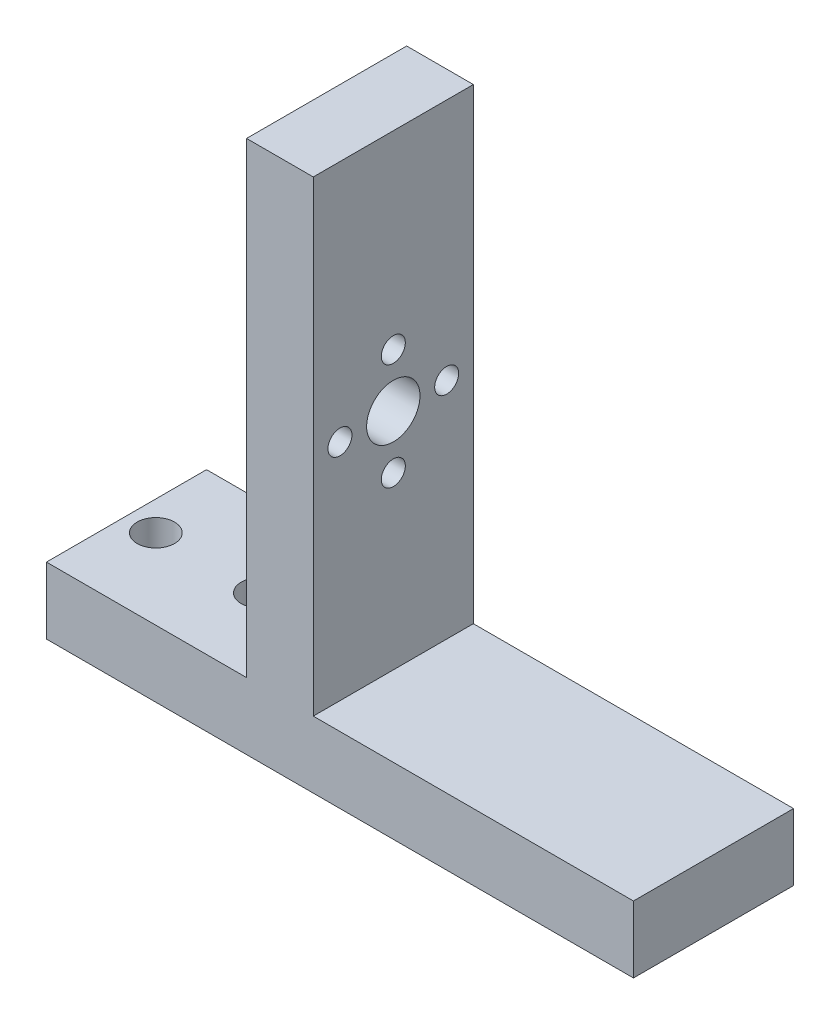
ISO-10303-21;
HEADER;
FILE_DESCRIPTION(('STEP AP214'),'2;1');
FILE_NAME('part.step','',(''),(''),'','','');
FILE_SCHEMA(('AUTOMOTIVE_DESIGN { 1 0 10303 214 1 1 1 1 }'));
ENDSEC;
DATA;
#1=APPLICATION_CONTEXT('core data for automotive mechanical design processes');
#2=APPLICATION_PROTOCOL_DEFINITION('international standard','automotive_design',2000,#1);
#3=PRODUCT_CONTEXT('',#1,'mechanical');
#4=PRODUCT('Part','Part','',(#3));
#5=PRODUCT_RELATED_PRODUCT_CATEGORY('part','',(#4));
#6=PRODUCT_DEFINITION_FORMATION('','',#4);
#7=PRODUCT_DEFINITION_CONTEXT('part definition',#1,'design');
#8=PRODUCT_DEFINITION('design','',#6,#7);
#9=PRODUCT_DEFINITION_SHAPE('','',#8);
#10=(LENGTH_UNIT() NAMED_UNIT(*) SI_UNIT(.MILLI.,.METRE.));
#11=(NAMED_UNIT(*) PLANE_ANGLE_UNIT() SI_UNIT($,.RADIAN.));
#12=(NAMED_UNIT(*) SI_UNIT($,.STERADIAN.) SOLID_ANGLE_UNIT());
#13=UNCERTAINTY_MEASURE_WITH_UNIT(LENGTH_MEASURE(1.E-05),#10,'distance_accuracy_value','');
#14=(GEOMETRIC_REPRESENTATION_CONTEXT(3) GLOBAL_UNCERTAINTY_ASSIGNED_CONTEXT((#13)) GLOBAL_UNIT_ASSIGNED_CONTEXT((#10,
#11,#12)) REPRESENTATION_CONTEXT('',''));
#15=CARTESIAN_POINT('',(0.,0.,0.));
#16=DIRECTION('',(0.,0.,1.));
#17=DIRECTION('',(1.,0.,0.));
#18=AXIS2_PLACEMENT_3D('',#15,#16,#17);
#19=CARTESIAN_POINT('',(-27.94,6.35,15.24));
#20=DIRECTION('',(1.,0.,0.));
#21=DIRECTION('',(0.,0.,-1.));
#22=AXIS2_PLACEMENT_3D('',#19,#20,#21);
#23=PLANE('',#22);
#24=DIRECTION('',(0.,-1.,0.));
#25=VECTOR('',#24,1.);
#26=CARTESIAN_POINT('',(-27.94,6.35,0.));
#27=LINE('',#26,#25);
#28=CARTESIAN_POINT('',(-27.94,6.35,0.));
#29=VERTEX_POINT('',#28);
#30=CARTESIAN_POINT('',(-27.94,0.,0.));
#31=VERTEX_POINT('',#30);
#32=EDGE_CURVE('E140',#29,#31,#27,.T.);
#33=ORIENTED_EDGE('',*,*,#32,.T.);
#34=DIRECTION('',(0.,0.,-1.));
#35=VECTOR('',#34,1.);
#36=CARTESIAN_POINT('',(-27.94,0.,15.24));
#37=LINE('',#36,#35);
#38=CARTESIAN_POINT('',(-27.94,0.,15.24));
#39=VERTEX_POINT('',#38);
#40=EDGE_CURVE('E11',#39,#31,#37,.T.);
#41=ORIENTED_EDGE('',*,*,#40,.F.);
#42=DIRECTION('',(0.,-1.,0.));
#43=VECTOR('',#42,1.);
#44=CARTESIAN_POINT('',(-27.94,6.35,15.24));
#45=LINE('',#44,#43);
#46=CARTESIAN_POINT('',(-27.94,6.35,15.24));
#47=VERTEX_POINT('',#46);
#48=EDGE_CURVE('E163',#47,#39,#45,.T.);
#49=ORIENTED_EDGE('',*,*,#48,.F.);
#50=DIRECTION('',(0.,0.,-1.));
#51=VECTOR('',#50,1.);
#52=CARTESIAN_POINT('',(-27.94,6.35,15.24));
#53=LINE('',#52,#51);
#54=EDGE_CURVE('E136',#47,#29,#53,.T.);
#55=ORIENTED_EDGE('',*,*,#54,.T.);
#56=EDGE_LOOP('',(#33,#41,#49,#55));
#57=FACE_BOUND('',#56,.T.);
#58=ADVANCED_FACE('F39',(#57),#23,.F.);
#59=CARTESIAN_POINT('',(-27.94,0.,15.24));
#60=DIRECTION('',(0.,1.,0.));
#61=DIRECTION('',(0.,0.,1.));
#62=AXIS2_PLACEMENT_3D('',#59,#60,#61);
#63=PLANE('',#62);
#64=CARTESIAN_POINT('',(-25.146,0.,7.62));
#65=DIRECTION('',(0.,1.,0.));
#66=DIRECTION('',(0.,0.,1.));
#67=AXIS2_PLACEMENT_3D('',#64,#65,#66);
#68=CIRCLE('',#67,1.778);
#69=CARTESIAN_POINT('',(-25.146,0.,9.398));
#70=VERTEX_POINT('',#69);
#71=EDGE_CURVE('E240',#70,#70,#68,.T.);
#72=ORIENTED_EDGE('',*,*,#71,.T.);
#73=EDGE_LOOP('',(#72));
#74=FACE_BOUND('',#73,.T.);
#75=CARTESIAN_POINT('',(-15.24,0.,7.62));
#76=DIRECTION('',(0.,1.,0.));
#77=DIRECTION('',(0.,0.,1.));
#78=AXIS2_PLACEMENT_3D('',#75,#76,#77);
#79=CIRCLE('',#78,1.778);
#80=CARTESIAN_POINT('',(-15.24,0.,9.398));
#81=VERTEX_POINT('',#80);
#82=EDGE_CURVE('E250',#81,#81,#79,.T.);
#83=ORIENTED_EDGE('',*,*,#82,.T.);
#84=EDGE_LOOP('',(#83));
#85=FACE_BOUND('',#84,.T.);
#86=DIRECTION('',(1.,0.,0.));
#87=VECTOR('',#86,1.);
#88=CARTESIAN_POINT('',(-27.94,0.,0.));
#89=LINE('',#88,#87);
#90=CARTESIAN_POINT('',(27.94,0.,0.));
#91=VERTEX_POINT('',#90);
#92=EDGE_CURVE('E144',#31,#91,#89,.T.);
#93=ORIENTED_EDGE('',*,*,#92,.T.);
#94=DIRECTION('',(0.,0.,-1.));
#95=VECTOR('',#94,1.);
#96=CARTESIAN_POINT('',(27.94,0.,15.24));
#97=LINE('',#96,#95);
#98=CARTESIAN_POINT('',(27.94,0.,15.24));
#99=VERTEX_POINT('',#98);
#100=EDGE_CURVE('E48',#99,#91,#97,.T.);
#101=ORIENTED_EDGE('',*,*,#100,.F.);
#102=DIRECTION('',(1.,0.,0.));
#103=VECTOR('',#102,1.);
#104=CARTESIAN_POINT('',(-27.94,0.,15.24));
#105=LINE('',#104,#103);
#106=EDGE_CURVE('E99',#39,#99,#105,.T.);
#107=ORIENTED_EDGE('',*,*,#106,.F.);
#108=ORIENTED_EDGE('',*,*,#40,.T.);
#109=EDGE_LOOP('',(#93,#101,#107,#108));
#110=FACE_BOUND('',#109,.T.);
#111=ADVANCED_FACE('F279',(#74,#85,#110),#63,.F.);
#112=CARTESIAN_POINT('',(27.94,0.,15.24));
#113=DIRECTION('',(-1.,0.,0.));
#114=DIRECTION('',(0.,0.,1.));
#115=AXIS2_PLACEMENT_3D('',#112,#113,#114);
#116=PLANE('',#115);
#117=DIRECTION('',(0.,1.,0.));
#118=VECTOR('',#117,1.);
#119=CARTESIAN_POINT('',(27.94,0.,0.));
#120=LINE('',#119,#118);
#121=CARTESIAN_POINT('',(27.94,6.35,0.));
#122=VERTEX_POINT('',#121);
#123=EDGE_CURVE('E148',#91,#122,#120,.T.);
#124=ORIENTED_EDGE('',*,*,#123,.T.);
#125=DIRECTION('',(0.,0.,-1.));
#126=VECTOR('',#125,1.);
#127=CARTESIAN_POINT('',(27.94,6.35,15.24));
#128=LINE('',#127,#126);
#129=CARTESIAN_POINT('',(27.94,6.35,15.24));
#130=VERTEX_POINT('',#129);
#131=EDGE_CURVE('E174',#130,#122,#128,.T.);
#132=ORIENTED_EDGE('',*,*,#131,.F.);
#133=DIRECTION('',(0.,1.,0.));
#134=VECTOR('',#133,1.);
#135=CARTESIAN_POINT('',(27.94,0.,15.24));
#136=LINE('',#135,#134);
#137=EDGE_CURVE('E184',#99,#130,#136,.T.);
#138=ORIENTED_EDGE('',*,*,#137,.F.);
#139=ORIENTED_EDGE('',*,*,#100,.T.);
#140=EDGE_LOOP('',(#124,#132,#138,#139));
#141=FACE_BOUND('',#140,.T.);
#142=ADVANCED_FACE('F182',(#141),#116,.F.);
#143=CARTESIAN_POINT('',(27.94,6.35,15.24));
#144=DIRECTION('',(0.,-1.,0.));
#145=DIRECTION('',(1.,0.,0.));
#146=AXIS2_PLACEMENT_3D('',#143,#144,#145);
#147=PLANE('',#146);
#148=DIRECTION('',(-1.,0.,0.));
#149=VECTOR('',#148,1.);
#150=CARTESIAN_POINT('',(27.94,6.35,0.));
#151=LINE('',#150,#149);
#152=CARTESIAN_POINT('',(-2.54,6.35,0.));
#153=VERTEX_POINT('',#152);
#154=EDGE_CURVE('E151',#122,#153,#151,.T.);
#155=ORIENTED_EDGE('',*,*,#154,.T.);
#156=DIRECTION('',(0.,0.,-1.));
#157=VECTOR('',#156,1.);
#158=CARTESIAN_POINT('',(-2.54,6.35,15.24));
#159=LINE('',#158,#157);
#160=CARTESIAN_POINT('',(-2.54,6.35,15.24));
#161=VERTEX_POINT('',#160);
#162=EDGE_CURVE('E170',#161,#153,#159,.T.);
#163=ORIENTED_EDGE('',*,*,#162,.F.);
#164=DIRECTION('',(-1.,0.,0.));
#165=VECTOR('',#164,1.);
#166=CARTESIAN_POINT('',(27.94,6.35,15.24));
#167=LINE('',#166,#165);
#168=EDGE_CURVE('E197',#130,#161,#167,.T.);
#169=ORIENTED_EDGE('',*,*,#168,.F.);
#170=ORIENTED_EDGE('',*,*,#131,.T.);
#171=EDGE_LOOP('',(#155,#163,#169,#170));
#172=FACE_BOUND('',#171,.T.);
#173=ADVANCED_FACE('F192',(#172),#147,.F.);
#174=CARTESIAN_POINT('',(-2.54,6.35,15.24));
#175=DIRECTION('',(-1.,0.,0.));
#176=DIRECTION('',(0.,-1.,0.));
#177=AXIS2_PLACEMENT_3D('',#174,#175,#176);
#178=PLANE('',#177);
#179=CARTESIAN_POINT('',(-2.54,32.766,7.62));
#180=DIRECTION('',(-1.,0.,0.));
#181=DIRECTION('',(0.,-1.,0.));
#182=AXIS2_PLACEMENT_3D('',#179,#180,#181);
#183=CIRCLE('',#182,1.143);
#184=CARTESIAN_POINT('',(-2.54,31.623,7.62));
#185=VERTEX_POINT('',#184);
#186=EDGE_CURVE('E145',#185,#185,#183,.T.);
#187=ORIENTED_EDGE('',*,*,#186,.T.);
#188=EDGE_LOOP('',(#187));
#189=FACE_BOUND('',#188,.T.);
#190=CARTESIAN_POINT('',(-2.54,27.686,2.54));
#191=DIRECTION('',(-1.,0.,0.));
#192=DIRECTION('',(0.,-1.,0.));
#193=AXIS2_PLACEMENT_3D('',#190,#191,#192);
#194=CIRCLE('',#193,1.143);
#195=CARTESIAN_POINT('',(-2.54,26.543,2.54));
#196=VERTEX_POINT('',#195);
#197=EDGE_CURVE('E210',#196,#196,#194,.T.);
#198=ORIENTED_EDGE('',*,*,#197,.T.);
#199=EDGE_LOOP('',(#198));
#200=FACE_BOUND('',#199,.T.);
#201=CARTESIAN_POINT('',(-2.54,22.606,7.62));
#202=DIRECTION('',(-1.,0.,0.));
#203=DIRECTION('',(0.,-1.,0.));
#204=AXIS2_PLACEMENT_3D('',#201,#202,#203);
#205=CIRCLE('',#204,1.143);
#206=CARTESIAN_POINT('',(-2.54,21.463,7.62));
#207=VERTEX_POINT('',#206);
#208=EDGE_CURVE('E214',#207,#207,#205,.T.);
#209=ORIENTED_EDGE('',*,*,#208,.T.);
#210=EDGE_LOOP('',(#209));
#211=FACE_BOUND('',#210,.T.);
#212=CARTESIAN_POINT('',(-2.54,27.686,12.7));
#213=DIRECTION('',(-1.,0.,0.));
#214=DIRECTION('',(0.,-1.,0.));
#215=AXIS2_PLACEMENT_3D('',#212,#213,#214);
#216=CIRCLE('',#215,1.143);
#217=CARTESIAN_POINT('',(-2.54,26.543,12.7));
#218=VERTEX_POINT('',#217);
#219=EDGE_CURVE('E218',#218,#218,#216,.T.);
#220=ORIENTED_EDGE('',*,*,#219,.T.);
#221=EDGE_LOOP('',(#220));
#222=FACE_BOUND('',#221,.T.);
#223=CARTESIAN_POINT('',(-2.54,27.686,7.62));
#224=DIRECTION('',(-1.,0.,0.));
#225=DIRECTION('',(0.,-1.,0.));
#226=AXIS2_PLACEMENT_3D('',#223,#224,#225);
#227=CIRCLE('',#226,2.54);
#228=CARTESIAN_POINT('',(-2.54,25.146,7.62));
#229=VERTEX_POINT('',#228);
#230=EDGE_CURVE('E222',#229,#229,#227,.T.);
#231=ORIENTED_EDGE('',*,*,#230,.T.);
#232=EDGE_LOOP('',(#231));
#233=FACE_BOUND('',#232,.T.);
#234=DIRECTION('',(0.,1.,0.));
#235=VECTOR('',#234,1.);
#236=CARTESIAN_POINT('',(-2.54,6.35,0.));
#237=LINE('',#236,#235);
#238=CARTESIAN_POINT('',(-2.54,50.8,0.));
#239=VERTEX_POINT('',#238);
#240=EDGE_CURVE('E154',#153,#239,#237,.T.);
#241=ORIENTED_EDGE('',*,*,#240,.T.);
#242=DIRECTION('',(0.,0.,-1.));
#243=VECTOR('',#242,1.);
#244=CARTESIAN_POINT('',(-2.54,50.8,15.24));
#245=LINE('',#244,#243);
#246=CARTESIAN_POINT('',(-2.54,50.8,15.24));
#247=VERTEX_POINT('',#246);
#248=EDGE_CURVE('E129',#247,#239,#245,.T.);
#249=ORIENTED_EDGE('',*,*,#248,.F.);
#250=DIRECTION('',(0.,1.,0.));
#251=VECTOR('',#250,1.);
#252=CARTESIAN_POINT('',(-2.54,6.35,15.24));
#253=LINE('',#252,#251);
#254=EDGE_CURVE('E118',#161,#247,#253,.T.);
#255=ORIENTED_EDGE('',*,*,#254,.F.);
#256=ORIENTED_EDGE('',*,*,#162,.T.);
#257=EDGE_LOOP('',(#241,#249,#255,#256));
#258=FACE_BOUND('',#257,.T.);
#259=ADVANCED_FACE('F195',(#189,#200,#211,#222,#233,#258),#178,.F.);
#260=CARTESIAN_POINT('',(-2.54,50.8,15.24));
#261=DIRECTION('',(0.,-1.,0.));
#262=DIRECTION('',(0.,0.,-1.));
#263=AXIS2_PLACEMENT_3D('',#260,#261,#262);
#264=PLANE('',#263);
#265=DIRECTION('',(-1.,0.,0.));
#266=VECTOR('',#265,1.);
#267=CARTESIAN_POINT('',(-2.54,50.8,0.));
#268=LINE('',#267,#266);
#269=CARTESIAN_POINT('',(-8.89,50.8,0.));
#270=VERTEX_POINT('',#269);
#271=EDGE_CURVE('E127',#239,#270,#268,.T.);
#272=ORIENTED_EDGE('',*,*,#271,.T.);
#273=DIRECTION('',(0.,0.,-1.));
#274=VECTOR('',#273,1.);
#275=CARTESIAN_POINT('',(-8.89,50.8,15.24));
#276=LINE('',#275,#274);
#277=CARTESIAN_POINT('',(-8.89,50.8,15.24));
#278=VERTEX_POINT('',#277);
#279=EDGE_CURVE('E124',#278,#270,#276,.T.);
#280=ORIENTED_EDGE('',*,*,#279,.F.);
#281=DIRECTION('',(-1.,0.,0.));
#282=VECTOR('',#281,1.);
#283=CARTESIAN_POINT('',(-2.54,50.8,15.24));
#284=LINE('',#283,#282);
#285=EDGE_CURVE('E112',#247,#278,#284,.T.);
#286=ORIENTED_EDGE('',*,*,#285,.F.);
#287=ORIENTED_EDGE('',*,*,#248,.T.);
#288=EDGE_LOOP('',(#272,#280,#286,#287));
#289=FACE_BOUND('',#288,.T.);
#290=ADVANCED_FACE('F125',(#289),#264,.F.);
#291=CARTESIAN_POINT('',(-8.89,50.8,15.24));
#292=DIRECTION('',(1.,0.,0.));
#293=DIRECTION('',(0.,1.,0.));
#294=AXIS2_PLACEMENT_3D('',#291,#292,#293);
#295=PLANE('',#294);
#296=CARTESIAN_POINT('',(-8.89,32.766,7.62));
#297=DIRECTION('',(-1.,0.,0.));
#298=DIRECTION('',(0.,-1.,0.));
#299=AXIS2_PLACEMENT_3D('',#296,#297,#298);
#300=CIRCLE('',#299,1.143);
#301=CARTESIAN_POINT('',(-8.89,31.623,7.62));
#302=VERTEX_POINT('',#301);
#303=EDGE_CURVE('E226',#302,#302,#300,.T.);
#304=ORIENTED_EDGE('',*,*,#303,.F.);
#305=EDGE_LOOP('',(#304));
#306=FACE_BOUND('',#305,.T.);
#307=CARTESIAN_POINT('',(-8.89,27.686,2.54));
#308=DIRECTION('',(-1.,0.,0.));
#309=DIRECTION('',(0.,-1.,0.));
#310=AXIS2_PLACEMENT_3D('',#307,#308,#309);
#311=CIRCLE('',#310,1.143);
#312=CARTESIAN_POINT('',(-8.89,26.543,2.54));
#313=VERTEX_POINT('',#312);
#314=EDGE_CURVE('E236',#313,#313,#311,.T.);
#315=ORIENTED_EDGE('',*,*,#314,.F.);
#316=EDGE_LOOP('',(#315));
#317=FACE_BOUND('',#316,.T.);
#318=CARTESIAN_POINT('',(-8.89,22.606,7.62));
#319=DIRECTION('',(-1.,0.,0.));
#320=DIRECTION('',(0.,-1.,0.));
#321=AXIS2_PLACEMENT_3D('',#318,#319,#320);
#322=CIRCLE('',#321,1.143);
#323=CARTESIAN_POINT('',(-8.89,21.463,7.62));
#324=VERTEX_POINT('',#323);
#325=EDGE_CURVE('E232',#324,#324,#322,.T.);
#326=ORIENTED_EDGE('',*,*,#325,.F.);
#327=EDGE_LOOP('',(#326));
#328=FACE_BOUND('',#327,.T.);
#329=CARTESIAN_POINT('',(-8.89,27.686,12.7));
#330=DIRECTION('',(-1.,0.,0.));
#331=DIRECTION('',(0.,-1.,0.));
#332=AXIS2_PLACEMENT_3D('',#329,#330,#331);
#333=CIRCLE('',#332,1.143);
#334=CARTESIAN_POINT('',(-8.89,26.543,12.7));
#335=VERTEX_POINT('',#334);
#336=EDGE_CURVE('E227',#335,#335,#333,.T.);
#337=ORIENTED_EDGE('',*,*,#336,.F.);
#338=EDGE_LOOP('',(#337));
#339=FACE_BOUND('',#338,.T.);
#340=CARTESIAN_POINT('',(-8.89,27.686,7.62));
#341=DIRECTION('',(-1.,0.,0.));
#342=DIRECTION('',(0.,-1.,0.));
#343=AXIS2_PLACEMENT_3D('',#340,#341,#342);
#344=CIRCLE('',#343,2.54);
#345=CARTESIAN_POINT('',(-8.89,25.146,7.62));
#346=VERTEX_POINT('',#345);
#347=EDGE_CURVE('E231',#346,#346,#344,.T.);
#348=ORIENTED_EDGE('',*,*,#347,.F.);
#349=EDGE_LOOP('',(#348));
#350=FACE_BOUND('',#349,.T.);
#351=DIRECTION('',(0.,-1.,0.));
#352=VECTOR('',#351,1.);
#353=CARTESIAN_POINT('',(-8.89,50.8,0.));
#354=LINE('',#353,#352);
#355=CARTESIAN_POINT('',(-8.89,6.35,0.));
#356=VERTEX_POINT('',#355);
#357=EDGE_CURVE('E85',#270,#356,#354,.T.);
#358=ORIENTED_EDGE('',*,*,#357,.T.);
#359=DIRECTION('',(0.,0.,-1.));
#360=VECTOR('',#359,1.);
#361=CARTESIAN_POINT('',(-8.89,6.35,15.24));
#362=LINE('',#361,#360);
#363=CARTESIAN_POINT('',(-8.89,6.35,15.24));
#364=VERTEX_POINT('',#363);
#365=EDGE_CURVE('E130',#364,#356,#362,.T.);
#366=ORIENTED_EDGE('',*,*,#365,.F.);
#367=DIRECTION('',(0.,-1.,0.));
#368=VECTOR('',#367,1.);
#369=CARTESIAN_POINT('',(-8.89,50.8,15.24));
#370=LINE('',#369,#368);
#371=EDGE_CURVE('E116',#278,#364,#370,.T.);
#372=ORIENTED_EDGE('',*,*,#371,.F.);
#373=ORIENTED_EDGE('',*,*,#279,.T.);
#374=EDGE_LOOP('',(#358,#366,#372,#373));
#375=FACE_BOUND('',#374,.T.);
#376=ADVANCED_FACE('F132',(#306,#317,#328,#339,#350,#375),#295,.F.);
#377=CARTESIAN_POINT('',(-8.89,6.35,15.24));
#378=DIRECTION('',(0.,-1.,0.));
#379=DIRECTION('',(1.,0.,0.));
#380=AXIS2_PLACEMENT_3D('',#377,#378,#379);
#381=PLANE('',#380);
#382=CARTESIAN_POINT('',(-25.146,6.35,7.62));
#383=DIRECTION('',(0.,1.,0.));
#384=DIRECTION('',(-1.,0.,0.));
#385=AXIS2_PLACEMENT_3D('',#382,#383,#384);
#386=CIRCLE('',#385,1.778);
#387=CARTESIAN_POINT('',(-26.924,6.35,7.62));
#388=VERTEX_POINT('',#387);
#389=EDGE_CURVE('E254',#388,#388,#386,.T.);
#390=ORIENTED_EDGE('',*,*,#389,.F.);
#391=EDGE_LOOP('',(#390));
#392=FACE_BOUND('',#391,.T.);
#393=CARTESIAN_POINT('',(-15.24,6.35,7.62));
#394=DIRECTION('',(0.,1.,0.));
#395=DIRECTION('',(-1.,0.,0.));
#396=AXIS2_PLACEMENT_3D('',#393,#394,#395);
#397=CIRCLE('',#396,1.778);
#398=CARTESIAN_POINT('',(-17.018,6.35,7.62));
#399=VERTEX_POINT('',#398);
#400=EDGE_CURVE('E255',#399,#399,#397,.T.);
#401=ORIENTED_EDGE('',*,*,#400,.F.);
#402=EDGE_LOOP('',(#401));
#403=FACE_BOUND('',#402,.T.);
#404=DIRECTION('',(-1.,0.,0.));
#405=VECTOR('',#404,1.);
#406=CARTESIAN_POINT('',(-8.89,6.35,0.));
#407=LINE('',#406,#405);
#408=EDGE_CURVE('E91',#356,#29,#407,.T.);
#409=ORIENTED_EDGE('',*,*,#408,.T.);
#410=ORIENTED_EDGE('',*,*,#54,.F.);
#411=DIRECTION('',(-1.,0.,0.));
#412=VECTOR('',#411,1.);
#413=CARTESIAN_POINT('',(-8.89,6.35,15.24));
#414=LINE('',#413,#412);
#415=EDGE_CURVE('E56',#364,#47,#414,.T.);
#416=ORIENTED_EDGE('',*,*,#415,.F.);
#417=ORIENTED_EDGE('',*,*,#365,.T.);
#418=EDGE_LOOP('',(#409,#410,#416,#417));
#419=FACE_BOUND('',#418,.T.);
#420=ADVANCED_FACE('F266',(#392,#403,#419),#381,.F.);
#421=CARTESIAN_POINT('',(0.,0.,15.24));
#422=DIRECTION('',(0.,0.,1.));
#423=DIRECTION('',(1.,0.,0.));
#424=AXIS2_PLACEMENT_3D('',#421,#422,#423);
#425=PLANE('',#424);
#426=ORIENTED_EDGE('',*,*,#48,.T.);
#427=ORIENTED_EDGE('',*,*,#106,.T.);
#428=ORIENTED_EDGE('',*,*,#137,.T.);
#429=ORIENTED_EDGE('',*,*,#168,.T.);
#430=ORIENTED_EDGE('',*,*,#254,.T.);
#431=ORIENTED_EDGE('',*,*,#285,.T.);
#432=ORIENTED_EDGE('',*,*,#371,.T.);
#433=ORIENTED_EDGE('',*,*,#415,.T.);
#434=EDGE_LOOP('',(#426,#427,#428,#429,#430,#431,#432,#433));
#435=FACE_BOUND('',#434,.T.);
#436=ADVANCED_FACE('F114',(#435),#425,.T.);
#437=CARTESIAN_POINT('',(0.,0.,0.));
#438=DIRECTION('',(0.,0.,1.));
#439=DIRECTION('',(1.,0.,0.));
#440=AXIS2_PLACEMENT_3D('',#437,#438,#439);
#441=PLANE('',#440);
#442=ORIENTED_EDGE('',*,*,#32,.F.);
#443=ORIENTED_EDGE('',*,*,#408,.F.);
#444=ORIENTED_EDGE('',*,*,#357,.F.);
#445=ORIENTED_EDGE('',*,*,#271,.F.);
#446=ORIENTED_EDGE('',*,*,#240,.F.);
#447=ORIENTED_EDGE('',*,*,#154,.F.);
#448=ORIENTED_EDGE('',*,*,#123,.F.);
#449=ORIENTED_EDGE('',*,*,#92,.F.);
#450=EDGE_LOOP('',(#442,#443,#444,#445,#446,#447,#448,#449));
#451=FACE_BOUND('',#450,.T.);
#452=ADVANCED_FACE('F188',(#451),#441,.F.);
#453=CARTESIAN_POINT('',(6.35,27.686,7.62));
#454=DIRECTION('',(-1.,0.,0.));
#455=DIRECTION('',(0.,-1.,0.));
#456=AXIS2_PLACEMENT_3D('',#453,#454,#455);
#457=CYLINDRICAL_SURFACE('',#456,2.54);
#458=ORIENTED_EDGE('',*,*,#347,.T.);
#459=EDGE_LOOP('',(#458));
#460=FACE_BOUND('',#459,.T.);
#461=ORIENTED_EDGE('',*,*,#230,.F.);
#462=EDGE_LOOP('',(#461));
#463=FACE_BOUND('',#462,.T.);
#464=ADVANCED_FACE('F343',(#460,#463),#457,.F.);
#465=CARTESIAN_POINT('',(6.35,27.686,12.7));
#466=DIRECTION('',(-1.,0.,0.));
#467=DIRECTION('',(0.,-1.,0.));
#468=AXIS2_PLACEMENT_3D('',#465,#466,#467);
#469=CYLINDRICAL_SURFACE('',#468,1.143);
#470=ORIENTED_EDGE('',*,*,#336,.T.);
#471=EDGE_LOOP('',(#470));
#472=FACE_BOUND('',#471,.T.);
#473=ORIENTED_EDGE('',*,*,#219,.F.);
#474=EDGE_LOOP('',(#473));
#475=FACE_BOUND('',#474,.T.);
#476=ADVANCED_FACE('F349',(#472,#475),#469,.F.);
#477=CARTESIAN_POINT('',(6.35,22.606,7.62));
#478=DIRECTION('',(-1.,0.,0.));
#479=DIRECTION('',(0.,-1.,0.));
#480=AXIS2_PLACEMENT_3D('',#477,#478,#479);
#481=CYLINDRICAL_SURFACE('',#480,1.143);
#482=ORIENTED_EDGE('',*,*,#325,.T.);
#483=EDGE_LOOP('',(#482));
#484=FACE_BOUND('',#483,.T.);
#485=ORIENTED_EDGE('',*,*,#208,.F.);
#486=EDGE_LOOP('',(#485));
#487=FACE_BOUND('',#486,.T.);
#488=ADVANCED_FACE('F357',(#484,#487),#481,.F.);
#489=CARTESIAN_POINT('',(6.35,27.686,2.54));
#490=DIRECTION('',(-1.,0.,0.));
#491=DIRECTION('',(0.,-1.,0.));
#492=AXIS2_PLACEMENT_3D('',#489,#490,#491);
#493=CYLINDRICAL_SURFACE('',#492,1.143);
#494=ORIENTED_EDGE('',*,*,#314,.T.);
#495=EDGE_LOOP('',(#494));
#496=FACE_BOUND('',#495,.T.);
#497=ORIENTED_EDGE('',*,*,#197,.F.);
#498=EDGE_LOOP('',(#497));
#499=FACE_BOUND('',#498,.T.);
#500=ADVANCED_FACE('F365',(#496,#499),#493,.F.);
#501=CARTESIAN_POINT('',(6.35,32.766,7.62));
#502=DIRECTION('',(-1.,0.,0.));
#503=DIRECTION('',(0.,-1.,0.));
#504=AXIS2_PLACEMENT_3D('',#501,#502,#503);
#505=CYLINDRICAL_SURFACE('',#504,1.143);
#506=ORIENTED_EDGE('',*,*,#303,.T.);
#507=EDGE_LOOP('',(#506));
#508=FACE_BOUND('',#507,.T.);
#509=ORIENTED_EDGE('',*,*,#186,.F.);
#510=EDGE_LOOP('',(#509));
#511=FACE_BOUND('',#510,.T.);
#512=ADVANCED_FACE('F275',(#508,#511),#505,.F.);
#513=CARTESIAN_POINT('',(-15.24,-8.89,7.62));
#514=DIRECTION('',(0.,1.,0.));
#515=DIRECTION('',(-1.,0.,0.));
#516=AXIS2_PLACEMENT_3D('',#513,#514,#515);
#517=CYLINDRICAL_SURFACE('',#516,1.778);
#518=ORIENTED_EDGE('',*,*,#400,.T.);
#519=EDGE_LOOP('',(#518));
#520=FACE_BOUND('',#519,.T.);
#521=ORIENTED_EDGE('',*,*,#82,.F.);
#522=EDGE_LOOP('',(#521));
#523=FACE_BOUND('',#522,.T.);
#524=ADVANCED_FACE('F272',(#520,#523),#517,.F.);
#525=CARTESIAN_POINT('',(-25.146,-8.89,7.62));
#526=DIRECTION('',(0.,1.,0.));
#527=DIRECTION('',(-1.,0.,0.));
#528=AXIS2_PLACEMENT_3D('',#525,#526,#527);
#529=CYLINDRICAL_SURFACE('',#528,1.778);
#530=ORIENTED_EDGE('',*,*,#389,.T.);
#531=EDGE_LOOP('',(#530));
#532=FACE_BOUND('',#531,.T.);
#533=ORIENTED_EDGE('',*,*,#71,.F.);
#534=EDGE_LOOP('',(#533));
#535=FACE_BOUND('',#534,.T.);
#536=ADVANCED_FACE('F263',(#532,#535),#529,.F.);
#537=CLOSED_SHELL('',(#58,#111,#142,#173,#259,#290,#376,#420,#436,#452,#464,#476,#488,#500,#512,
#524,#536));
#538=MANIFOLD_SOLID_BREP('B2',#537);
#539=ADVANCED_BREP_SHAPE_REPRESENTATION('',(#18,#538),#14);
#540=SHAPE_DEFINITION_REPRESENTATION(#9,#539);
ENDSEC;
END-ISO-10303-21;
